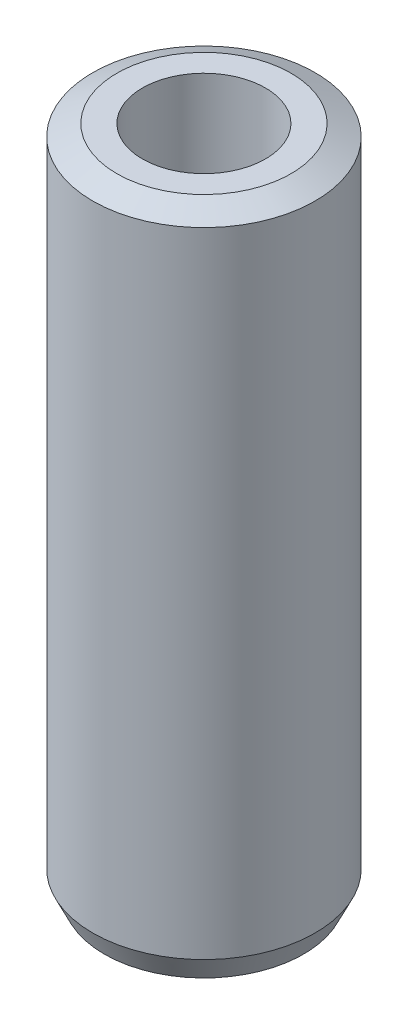
ISO-10303-21;
HEADER;
FILE_DESCRIPTION(('STEP AP214'),'2;1');
FILE_NAME('part.step','',(''),(''),'','','');
FILE_SCHEMA(('AUTOMOTIVE_DESIGN { 1 0 10303 214 1 1 1 1 }'));
ENDSEC;
DATA;
#1=APPLICATION_CONTEXT('core data for automotive mechanical design processes');
#2=APPLICATION_PROTOCOL_DEFINITION('international standard','automotive_design',2000,#1);
#3=PRODUCT_CONTEXT('',#1,'mechanical');
#4=PRODUCT('Part','Part','',(#3));
#5=PRODUCT_RELATED_PRODUCT_CATEGORY('part','',(#4));
#6=PRODUCT_DEFINITION_FORMATION('','',#4);
#7=PRODUCT_DEFINITION_CONTEXT('part definition',#1,'design');
#8=PRODUCT_DEFINITION('design','',#6,#7);
#9=PRODUCT_DEFINITION_SHAPE('','',#8);
#10=(LENGTH_UNIT() NAMED_UNIT(*) SI_UNIT(.MILLI.,.METRE.));
#11=(NAMED_UNIT(*) PLANE_ANGLE_UNIT() SI_UNIT($,.RADIAN.));
#12=(NAMED_UNIT(*) SI_UNIT($,.STERADIAN.) SOLID_ANGLE_UNIT());
#13=UNCERTAINTY_MEASURE_WITH_UNIT(LENGTH_MEASURE(1.E-05),#10,'distance_accuracy_value','');
#14=(GEOMETRIC_REPRESENTATION_CONTEXT(3) GLOBAL_UNCERTAINTY_ASSIGNED_CONTEXT((#13)) GLOBAL_UNIT_ASSIGNED_CONTEXT((#10,
#11,#12)) REPRESENTATION_CONTEXT('',''));
#15=CARTESIAN_POINT('',(0.,0.,0.));
#16=DIRECTION('',(0.,0.,1.));
#17=DIRECTION('',(1.,0.,0.));
#18=AXIS2_PLACEMENT_3D('',#15,#16,#17);
#19=CARTESIAN_POINT('',(0.,301.030965562658,0.));
#20=DIRECTION('',(0.,-1.,0.));
#21=DIRECTION('',(0.,0.,-1.));
#22=AXIS2_PLACEMENT_3D('',#19,#20,#21);
#23=CYLINDRICAL_SURFACE('',#22,50.);
#24=CARTESIAN_POINT('',(0.,295.831975147186,0.));
#25=DIRECTION('',(0.,1.,0.));
#26=DIRECTION('',(0.,0.,1.));
#27=AXIS2_PLACEMENT_3D('',#24,#25,#26);
#28=CIRCLE('',#27,50.);
#29=CARTESIAN_POINT('',(0.,295.831975147186,50.));
#30=VERTEX_POINT('',#29);
#31=EDGE_CURVE('E50',#30,#30,#28,.F.);
#32=ORIENTED_EDGE('',*,*,#31,.T.);
#33=EDGE_LOOP('',(#32));
#34=FACE_BOUND('',#33,.T.);
#35=CARTESIAN_POINT('',(0.,10.8462330628136,0.));
#36=DIRECTION('',(0.,1.,0.));
#37=DIRECTION('',(0.,0.,1.));
#38=AXIS2_PLACEMENT_3D('',#35,#36,#37);
#39=CIRCLE('',#38,50.);
#40=CARTESIAN_POINT('',(0.,10.8462330628136,50.));
#41=VERTEX_POINT('',#40);
#42=EDGE_CURVE('E51',#41,#41,#39,.T.);
#43=ORIENTED_EDGE('',*,*,#42,.T.);
#44=EDGE_LOOP('',(#43));
#45=FACE_BOUND('',#44,.T.);
#46=ADVANCED_FACE('F39',(#34,#45),#23,.T.);
#47=CARTESIAN_POINT('',(0.,301.030965562658,0.));
#48=DIRECTION('',(0.,1.,0.));
#49=DIRECTION('',(0.,0.,1.));
#50=AXIS2_PLACEMENT_3D('',#47,#48,#49);
#51=PLANE('',#50);
#52=CARTESIAN_POINT('',(0.,301.030965562658,0.));
#53=DIRECTION('',(0.,1.,0.));
#54=DIRECTION('',(0.,0.,1.));
#55=AXIS2_PLACEMENT_3D('',#52,#53,#54);
#56=CIRCLE('',#55,39.1537669371865);
#57=CARTESIAN_POINT('',(0.,301.030965562658,39.1537669371865));
#58=VERTEX_POINT('',#57);
#59=EDGE_CURVE('E54',#58,#58,#56,.T.);
#60=ORIENTED_EDGE('',*,*,#59,.T.);
#61=EDGE_LOOP('',(#60));
#62=FACE_BOUND('',#61,.T.);
#63=CARTESIAN_POINT('',(0.,301.030965562658,0.));
#64=DIRECTION('',(0.,1.,0.));
#65=DIRECTION('',(0.,0.,1.));
#66=AXIS2_PLACEMENT_3D('',#63,#64,#65);
#67=CIRCLE('',#66,27.667980362871);
#68=CARTESIAN_POINT('',(0.,301.030965562658,27.667980362871));
#69=VERTEX_POINT('',#68);
#70=EDGE_CURVE('E58',#69,#69,#67,.T.);
#71=ORIENTED_EDGE('',*,*,#70,.F.);
#72=EDGE_LOOP('',(#71));
#73=FACE_BOUND('',#72,.T.);
#74=ADVANCED_FACE('F69',(#62,#73),#51,.T.);
#75=CARTESIAN_POINT('',(0.,0.,0.));
#76=DIRECTION('',(0.,1.,0.));
#77=DIRECTION('',(0.,0.,1.));
#78=AXIS2_PLACEMENT_3D('',#75,#76,#77);
#79=PLANE('',#78);
#80=CARTESIAN_POINT('',(0.,0.,0.));
#81=DIRECTION('',(0.,1.,0.));
#82=DIRECTION('',(0.,0.,1.));
#83=AXIS2_PLACEMENT_3D('',#80,#81,#82);
#84=CIRCLE('',#83,44.8010095845282);
#85=CARTESIAN_POINT('',(0.,0.,44.8010095845282));
#86=VERTEX_POINT('',#85);
#87=EDGE_CURVE('E10',#86,#86,#84,.F.);
#88=ORIENTED_EDGE('',*,*,#87,.T.);
#89=EDGE_LOOP('',(#88));
#90=FACE_BOUND('',#89,.T.);
#91=CARTESIAN_POINT('',(0.,0.,0.));
#92=DIRECTION('',(0.,1.,0.));
#93=DIRECTION('',(0.,0.,1.));
#94=AXIS2_PLACEMENT_3D('',#91,#92,#93);
#95=CIRCLE('',#94,27.667980362871);
#96=CARTESIAN_POINT('',(0.,0.,27.667980362871));
#97=VERTEX_POINT('',#96);
#98=EDGE_CURVE('E63',#97,#97,#95,.T.);
#99=ORIENTED_EDGE('',*,*,#98,.T.);
#100=EDGE_LOOP('',(#99));
#101=FACE_BOUND('',#100,.T.);
#102=ADVANCED_FACE('F75',(#90,#101),#79,.F.);
#103=CARTESIAN_POINT('',(0.,301.030965562658,0.));
#104=DIRECTION('',(0.,-1.,0.));
#105=DIRECTION('',(0.,0.,-1.));
#106=AXIS2_PLACEMENT_3D('',#103,#104,#105);
#107=CYLINDRICAL_SURFACE('',#106,27.667980362871);
#108=ORIENTED_EDGE('',*,*,#70,.T.);
#109=EDGE_LOOP('',(#108));
#110=FACE_BOUND('',#109,.T.);
#111=ORIENTED_EDGE('',*,*,#98,.F.);
#112=EDGE_LOOP('',(#111));
#113=FACE_BOUND('',#112,.T.);
#114=ADVANCED_FACE('F70',(#110,#113),#107,.F.);
#115=CARTESIAN_POINT('',(0.,301.030965562658,0.));
#116=DIRECTION('',(0.,-1.,0.));
#117=DIRECTION('',(0.,0.,-1.));
#118=AXIS2_PLACEMENT_3D('',#115,#116,#117);
#119=CONICAL_SURFACE('',#118,39.1537669371865,1.12381612001963);
#120=ORIENTED_EDGE('',*,*,#31,.F.);
#121=EDGE_LOOP('',(#120));
#122=FACE_BOUND('',#121,.T.);
#123=ORIENTED_EDGE('',*,*,#59,.F.);
#124=EDGE_LOOP('',(#123));
#125=FACE_BOUND('',#124,.T.);
#126=ADVANCED_FACE('F81',(#122,#125),#119,.T.);
#127=CARTESIAN_POINT('',(0.,10.8462330628136,0.));
#128=DIRECTION('',(0.,1.,0.));
#129=DIRECTION('',(0.,0.,1.));
#130=AXIS2_PLACEMENT_3D('',#127,#128,#129);
#131=CONICAL_SURFACE('',#130,50.,0.446980206775261);
#132=ORIENTED_EDGE('',*,*,#87,.F.);
#133=EDGE_LOOP('',(#132));
#134=FACE_BOUND('',#133,.T.);
#135=ORIENTED_EDGE('',*,*,#42,.F.);
#136=EDGE_LOOP('',(#135));
#137=FACE_BOUND('',#136,.T.);
#138=ADVANCED_FACE('F45',(#134,#137),#131,.T.);
#139=CLOSED_SHELL('',(#46,#74,#102,#114,#126,#138));
#140=MANIFOLD_SOLID_BREP('B2',#139);
#141=ADVANCED_BREP_SHAPE_REPRESENTATION('',(#18,#140),#14);
#142=SHAPE_DEFINITION_REPRESENTATION(#9,#141);
ENDSEC;
END-ISO-10303-21;
